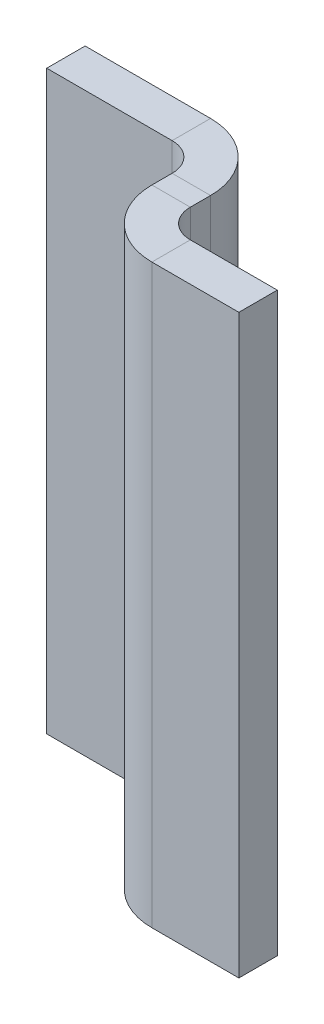
ISO-10303-21;
HEADER;
FILE_DESCRIPTION(('STEP AP214'),'2;1');
FILE_NAME('part.step','',(''),(''),'','','');
FILE_SCHEMA(('AUTOMOTIVE_DESIGN { 1 0 10303 214 1 1 1 1 }'));
ENDSEC;
DATA;
#1=APPLICATION_CONTEXT('core data for automotive mechanical design processes');
#2=APPLICATION_PROTOCOL_DEFINITION('international standard','automotive_design',2000,#1);
#3=PRODUCT_CONTEXT('',#1,'mechanical');
#4=PRODUCT('Part','Part','',(#3));
#5=PRODUCT_RELATED_PRODUCT_CATEGORY('part','',(#4));
#6=PRODUCT_DEFINITION_FORMATION('','',#4);
#7=PRODUCT_DEFINITION_CONTEXT('part definition',#1,'design');
#8=PRODUCT_DEFINITION('design','',#6,#7);
#9=PRODUCT_DEFINITION_SHAPE('','',#8);
#10=(LENGTH_UNIT() NAMED_UNIT(*) SI_UNIT(.MILLI.,.METRE.));
#11=(NAMED_UNIT(*) PLANE_ANGLE_UNIT() SI_UNIT($,.RADIAN.));
#12=(NAMED_UNIT(*) SI_UNIT($,.STERADIAN.) SOLID_ANGLE_UNIT());
#13=UNCERTAINTY_MEASURE_WITH_UNIT(LENGTH_MEASURE(1.E-05),#10,'distance_accuracy_value','');
#14=(GEOMETRIC_REPRESENTATION_CONTEXT(3) GLOBAL_UNCERTAINTY_ASSIGNED_CONTEXT((#13)) GLOBAL_UNIT_ASSIGNED_CONTEXT((#10,
#11,#12)) REPRESENTATION_CONTEXT('',''));
#15=CARTESIAN_POINT('',(0.,0.,0.));
#16=DIRECTION('',(0.,0.,1.));
#17=DIRECTION('',(1.,0.,0.));
#18=AXIS2_PLACEMENT_3D('',#15,#16,#17);
#19=CARTESIAN_POINT('',(5.,0.,0.));
#20=DIRECTION('',(0.,1.,0.));
#21=DIRECTION('',(0.,0.,1.));
#22=AXIS2_PLACEMENT_3D('',#19,#20,#21);
#23=PLANE('',#22);
#24=DIRECTION('',(-1.,0.,0.));
#25=VECTOR('',#24,1.);
#26=CARTESIAN_POINT('',(5.,0.,1.2634));
#27=LINE('',#26,#25);
#28=CARTESIAN_POINT('',(5.,0.,1.2634));
#29=VERTEX_POINT('',#28);
#30=CARTESIAN_POINT('',(4.,0.,1.26340000000001));
#31=VERTEX_POINT('',#30);
#32=EDGE_CURVE('E179',#29,#31,#27,.T.);
#33=ORIENTED_EDGE('',*,*,#32,.T.);
#34=DIRECTION('',(0.,0.,-1.));
#35=VECTOR('',#34,1.);
#36=CARTESIAN_POINT('',(4.,0.,0.));
#37=LINE('',#36,#35);
#38=CARTESIAN_POINT('',(4.,0.,0.736599999999997));
#39=VERTEX_POINT('',#38);
#40=EDGE_CURVE('E199',#31,#39,#37,.T.);
#41=ORIENTED_EDGE('',*,*,#40,.T.);
#42=DIRECTION('',(1.,0.,0.));
#43=VECTOR('',#42,1.);
#44=CARTESIAN_POINT('',(4.,0.,0.736599999999997));
#45=LINE('',#44,#43);
#46=CARTESIAN_POINT('',(5.,0.,0.736599999999994));
#47=VERTEX_POINT('',#46);
#48=EDGE_CURVE('E188',#39,#47,#45,.T.);
#49=ORIENTED_EDGE('',*,*,#48,.T.);
#50=DIRECTION('',(0.,0.,-1.));
#51=VECTOR('',#50,1.);
#52=CARTESIAN_POINT('',(5.,0.,0.));
#53=LINE('',#52,#51);
#54=EDGE_CURVE('E200',#29,#47,#53,.T.);
#55=ORIENTED_EDGE('',*,*,#54,.F.);
#56=EDGE_LOOP('',(#33,#41,#49,#55));
#57=FACE_BOUND('',#56,.T.);
#58=ADVANCED_FACE('F39',(#57),#23,.F.);
#59=CARTESIAN_POINT('',(5.00000000000001,15.,2.));
#60=DIRECTION('',(0.,-1.,0.));
#61=DIRECTION('',(0.,0.,-1.));
#62=AXIS2_PLACEMENT_3D('',#59,#60,#61);
#63=PLANE('',#62);
#64=DIRECTION('',(-1.,0.,0.));
#65=VECTOR('',#64,1.);
#66=CARTESIAN_POINT('',(5.,15.,1.2634));
#67=LINE('',#66,#65);
#68=CARTESIAN_POINT('',(5.,15.,1.2634));
#69=VERTEX_POINT('',#68);
#70=CARTESIAN_POINT('',(4.,15.,1.2634));
#71=VERTEX_POINT('',#70);
#72=EDGE_CURVE('E186',#69,#71,#67,.T.);
#73=ORIENTED_EDGE('',*,*,#72,.F.);
#74=DIRECTION('',(0.,0.,1.));
#75=VECTOR('',#74,1.);
#76=CARTESIAN_POINT('',(5.00000000000001,15.,2.));
#77=LINE('',#76,#75);
#78=CARTESIAN_POINT('',(5.,15.,0.736599999999994));
#79=VERTEX_POINT('',#78);
#80=EDGE_CURVE('E202',#79,#69,#77,.T.);
#81=ORIENTED_EDGE('',*,*,#80,.F.);
#82=DIRECTION('',(1.,0.,0.));
#83=VECTOR('',#82,1.);
#84=CARTESIAN_POINT('',(4.,15.,0.736599999999997));
#85=LINE('',#84,#83);
#86=CARTESIAN_POINT('',(4.,15.,0.736599999999997));
#87=VERTEX_POINT('',#86);
#88=EDGE_CURVE('E192',#87,#79,#85,.T.);
#89=ORIENTED_EDGE('',*,*,#88,.F.);
#90=DIRECTION('',(0.,0.,1.));
#91=VECTOR('',#90,1.);
#92=CARTESIAN_POINT('',(4.00000000000001,15.,2.));
#93=LINE('',#92,#91);
#94=EDGE_CURVE('E203',#87,#71,#93,.T.);
#95=ORIENTED_EDGE('',*,*,#94,.T.);
#96=EDGE_LOOP('',(#73,#81,#89,#95));
#97=FACE_BOUND('',#96,.T.);
#98=ADVANCED_FACE('F280',(#97),#63,.F.);
#99=CARTESIAN_POINT('',(5.,0.,0.));
#100=DIRECTION('',(-1.,0.,0.));
#101=DIRECTION('',(0.,0.,1.));
#102=AXIS2_PLACEMENT_3D('',#99,#100,#101);
#103=PLANE('',#102);
#104=DIRECTION('',(0.,-1.,0.));
#105=VECTOR('',#104,1.);
#106=CARTESIAN_POINT('',(5.,0.,1.2634));
#107=LINE('',#106,#105);
#108=EDGE_CURVE('E183',#29,#69,#107,.F.);
#109=ORIENTED_EDGE('',*,*,#108,.F.);
#110=ORIENTED_EDGE('',*,*,#54,.T.);
#111=DIRECTION('',(0.,-1.,0.));
#112=VECTOR('',#111,1.);
#113=CARTESIAN_POINT('',(5.,0.,0.736599999999994));
#114=LINE('',#113,#112);
#115=EDGE_CURVE('E195',#79,#47,#114,.T.);
#116=ORIENTED_EDGE('',*,*,#115,.F.);
#117=ORIENTED_EDGE('',*,*,#80,.T.);
#118=EDGE_LOOP('',(#109,#110,#116,#117));
#119=FACE_BOUND('',#118,.T.);
#120=ADVANCED_FACE('F277',(#119),#103,.F.);
#121=CARTESIAN_POINT('',(4.,0.,0.));
#122=DIRECTION('',(-1.,0.,0.));
#123=DIRECTION('',(0.,0.,1.));
#124=AXIS2_PLACEMENT_3D('',#121,#122,#123);
#125=PLANE('',#124);
#126=ORIENTED_EDGE('',*,*,#40,.F.);
#127=DIRECTION('',(0.,-1.,0.));
#128=VECTOR('',#127,1.);
#129=CARTESIAN_POINT('',(4.,0.,1.26340000000001));
#130=LINE('',#129,#128);
#131=EDGE_CURVE('E133',#31,#71,#130,.F.);
#132=ORIENTED_EDGE('',*,*,#131,.T.);
#133=ORIENTED_EDGE('',*,*,#94,.F.);
#134=DIRECTION('',(0.,1.,0.));
#135=VECTOR('',#134,1.);
#136=CARTESIAN_POINT('',(4.,0.,0.736599999999997));
#137=LINE('',#136,#135);
#138=EDGE_CURVE('E190',#39,#87,#137,.T.);
#139=ORIENTED_EDGE('',*,*,#138,.F.);
#140=EDGE_LOOP('',(#126,#132,#133,#139));
#141=FACE_BOUND('',#140,.T.);
#142=ADVANCED_FACE('F287',(#141),#125,.T.);
#143=CARTESIAN_POINT('',(0.,15.,-1.));
#144=DIRECTION('',(0.,1.,0.));
#145=DIRECTION('',(0.,0.,1.));
#146=AXIS2_PLACEMENT_3D('',#143,#144,#145);
#147=PLANE('',#146);
#148=DIRECTION('',(-1.,0.,0.));
#149=VECTOR('',#148,1.);
#150=CARTESIAN_POINT('',(0.,15.,0.));
#151=LINE('',#150,#149);
#152=CARTESIAN_POINT('',(3.2634,15.,0.));
#153=VERTEX_POINT('',#152);
#154=CARTESIAN_POINT('',(0.,15.,0.));
#155=VERTEX_POINT('',#154);
#156=EDGE_CURVE('E234',#153,#155,#151,.T.);
#157=ORIENTED_EDGE('',*,*,#156,.F.);
#158=DIRECTION('',(0.,0.,-1.));
#159=VECTOR('',#158,1.);
#160=CARTESIAN_POINT('',(3.2634,15.,0.));
#161=LINE('',#160,#159);
#162=CARTESIAN_POINT('',(3.2634,15.,-1.));
#163=VERTEX_POINT('',#162);
#164=EDGE_CURVE('E215',#153,#163,#161,.T.);
#165=ORIENTED_EDGE('',*,*,#164,.T.);
#166=DIRECTION('',(-1.,0.,0.));
#167=VECTOR('',#166,1.);
#168=CARTESIAN_POINT('',(0.,15.,-1.));
#169=LINE('',#168,#167);
#170=CARTESIAN_POINT('',(0.,15.,-1.));
#171=VERTEX_POINT('',#170);
#172=EDGE_CURVE('E237',#163,#171,#169,.T.);
#173=ORIENTED_EDGE('',*,*,#172,.T.);
#174=DIRECTION('',(0.,0.,1.));
#175=VECTOR('',#174,1.);
#176=CARTESIAN_POINT('',(0.,15.,-1.));
#177=LINE('',#176,#175);
#178=EDGE_CURVE('E11',#171,#155,#177,.T.);
#179=ORIENTED_EDGE('',*,*,#178,.T.);
#180=EDGE_LOOP('',(#157,#165,#173,#179));
#181=FACE_BOUND('',#180,.T.);
#182=ADVANCED_FACE('F251',(#181),#147,.T.);
#183=CARTESIAN_POINT('',(0.,0.,-1.));
#184=DIRECTION('',(0.,0.,-1.));
#185=DIRECTION('',(-1.,0.,0.));
#186=AXIS2_PLACEMENT_3D('',#183,#184,#185);
#187=PLANE('',#186);
#188=ORIENTED_EDGE('',*,*,#172,.F.);
#189=DIRECTION('',(0.,1.,0.));
#190=VECTOR('',#189,1.);
#191=CARTESIAN_POINT('',(3.2634,15.,-1.));
#192=LINE('',#191,#190);
#193=CARTESIAN_POINT('',(3.2634,0.,-1.));
#194=VERTEX_POINT('',#193);
#195=EDGE_CURVE('E210',#163,#194,#192,.F.);
#196=ORIENTED_EDGE('',*,*,#195,.T.);
#197=DIRECTION('',(1.,0.,0.));
#198=VECTOR('',#197,1.);
#199=CARTESIAN_POINT('',(0.,0.,-1.));
#200=LINE('',#199,#198);
#201=CARTESIAN_POINT('',(0.,0.,-1.));
#202=VERTEX_POINT('',#201);
#203=EDGE_CURVE('E233',#202,#194,#200,.T.);
#204=ORIENTED_EDGE('',*,*,#203,.F.);
#205=DIRECTION('',(0.,-1.,0.));
#206=VECTOR('',#205,1.);
#207=CARTESIAN_POINT('',(0.,0.,-1.));
#208=LINE('',#207,#206);
#209=EDGE_CURVE('E230',#171,#202,#208,.T.);
#210=ORIENTED_EDGE('',*,*,#209,.F.);
#211=EDGE_LOOP('',(#188,#196,#204,#210));
#212=FACE_BOUND('',#211,.T.);
#213=ADVANCED_FACE('F265',(#212),#187,.T.);
#214=CARTESIAN_POINT('',(0.,0.,0.));
#215=DIRECTION('',(0.,0.,-1.));
#216=DIRECTION('',(-1.,0.,0.));
#217=AXIS2_PLACEMENT_3D('',#214,#215,#216);
#218=PLANE('',#217);
#219=DIRECTION('',(0.,1.,0.));
#220=VECTOR('',#219,1.);
#221=CARTESIAN_POINT('',(3.2634,15.,0.));
#222=LINE('',#221,#220);
#223=CARTESIAN_POINT('',(3.2634,0.,0.));
#224=VERTEX_POINT('',#223);
#225=EDGE_CURVE('E221',#153,#224,#222,.F.);
#226=ORIENTED_EDGE('',*,*,#225,.F.);
#227=ORIENTED_EDGE('',*,*,#156,.T.);
#228=DIRECTION('',(0.,-1.,0.));
#229=VECTOR('',#228,1.);
#230=CARTESIAN_POINT('',(0.,0.,0.));
#231=LINE('',#230,#229);
#232=CARTESIAN_POINT('',(0.,0.,0.));
#233=VERTEX_POINT('',#232);
#234=EDGE_CURVE('E227',#155,#233,#231,.T.);
#235=ORIENTED_EDGE('',*,*,#234,.T.);
#236=DIRECTION('',(1.,0.,0.));
#237=VECTOR('',#236,1.);
#238=CARTESIAN_POINT('',(0.,0.,0.));
#239=LINE('',#238,#237);
#240=EDGE_CURVE('E241',#233,#224,#239,.T.);
#241=ORIENTED_EDGE('',*,*,#240,.T.);
#242=EDGE_LOOP('',(#226,#227,#235,#241));
#243=FACE_BOUND('',#242,.T.);
#244=ADVANCED_FACE('F247',(#243),#218,.F.);
#245=CARTESIAN_POINT('',(0.,0.,-1.));
#246=DIRECTION('',(-1.,0.,0.));
#247=DIRECTION('',(0.,0.,1.));
#248=AXIS2_PLACEMENT_3D('',#245,#246,#247);
#249=PLANE('',#248);
#250=ORIENTED_EDGE('',*,*,#234,.F.);
#251=ORIENTED_EDGE('',*,*,#178,.F.);
#252=ORIENTED_EDGE('',*,*,#209,.T.);
#253=DIRECTION('',(0.,0.,1.));
#254=VECTOR('',#253,1.);
#255=CARTESIAN_POINT('',(0.,0.,-1.));
#256=LINE('',#255,#254);
#257=EDGE_CURVE('E43',#202,#233,#256,.T.);
#258=ORIENTED_EDGE('',*,*,#257,.T.);
#259=EDGE_LOOP('',(#250,#251,#252,#258));
#260=FACE_BOUND('',#259,.T.);
#261=ADVANCED_FACE('F41',(#260),#249,.T.);
#262=CARTESIAN_POINT('',(0.,0.,-1.));
#263=DIRECTION('',(0.,-1.,0.));
#264=DIRECTION('',(0.,0.,-1.));
#265=AXIS2_PLACEMENT_3D('',#262,#263,#264);
#266=PLANE('',#265);
#267=DIRECTION('',(0.,0.,-1.));
#268=VECTOR('',#267,1.);
#269=CARTESIAN_POINT('',(3.2634,0.,0.));
#270=LINE('',#269,#268);
#271=EDGE_CURVE('E225',#224,#194,#270,.T.);
#272=ORIENTED_EDGE('',*,*,#271,.F.);
#273=ORIENTED_EDGE('',*,*,#240,.F.);
#274=ORIENTED_EDGE('',*,*,#257,.F.);
#275=ORIENTED_EDGE('',*,*,#203,.T.);
#276=EDGE_LOOP('',(#272,#273,#274,#275));
#277=FACE_BOUND('',#276,.T.);
#278=ADVANCED_FACE('F259',(#277),#266,.T.);
#279=CARTESIAN_POINT('',(3.2634,0.,0.7366));
#280=DIRECTION('',(0.,-1.,0.));
#281=DIRECTION('',(0.,0.,-1.));
#282=AXIS2_PLACEMENT_3D('',#279,#280,#281);
#283=PLANE('',#282);
#284=ORIENTED_EDGE('',*,*,#48,.F.);
#285=CARTESIAN_POINT('',(3.2634,0.,0.7366));
#286=DIRECTION('',(0.,1.,0.));
#287=DIRECTION('',(0.,0.,1.));
#288=AXIS2_PLACEMENT_3D('',#285,#286,#287);
#289=CIRCLE('',#288,0.7366);
#290=EDGE_CURVE('E218',#224,#39,#289,.F.);
#291=ORIENTED_EDGE('',*,*,#290,.F.);
#292=ORIENTED_EDGE('',*,*,#271,.T.);
#293=CARTESIAN_POINT('',(3.2634,0.,0.7366));
#294=DIRECTION('',(0.,1.,0.));
#295=DIRECTION('',(0.,0.,1.));
#296=AXIS2_PLACEMENT_3D('',#293,#294,#295);
#297=CIRCLE('',#296,1.7366);
#298=EDGE_CURVE('E62',#194,#47,#297,.F.);
#299=ORIENTED_EDGE('',*,*,#298,.T.);
#300=EDGE_LOOP('',(#284,#291,#292,#299));
#301=FACE_BOUND('',#300,.T.);
#302=ADVANCED_FACE('F263',(#301),#283,.T.);
#303=CARTESIAN_POINT('',(3.2634,15.,0.7366));
#304=DIRECTION('',(0.,-1.,0.));
#305=DIRECTION('',(0.,0.,-1.));
#306=AXIS2_PLACEMENT_3D('',#303,#304,#305);
#307=PLANE('',#306);
#308=CARTESIAN_POINT('',(3.2634,15.,0.7366));
#309=DIRECTION('',(0.,1.,0.));
#310=DIRECTION('',(0.,0.,1.));
#311=AXIS2_PLACEMENT_3D('',#308,#309,#310);
#312=CIRCLE('',#311,0.7366);
#313=EDGE_CURVE('E206',#87,#153,#312,.T.);
#314=ORIENTED_EDGE('',*,*,#313,.F.);
#315=ORIENTED_EDGE('',*,*,#88,.T.);
#316=CARTESIAN_POINT('',(3.2634,15.,0.7366));
#317=DIRECTION('',(0.,1.,0.));
#318=DIRECTION('',(0.,0.,1.));
#319=AXIS2_PLACEMENT_3D('',#316,#317,#318);
#320=CIRCLE('',#319,1.7366);
#321=EDGE_CURVE('E213',#79,#163,#320,.T.);
#322=ORIENTED_EDGE('',*,*,#321,.T.);
#323=ORIENTED_EDGE('',*,*,#164,.F.);
#324=EDGE_LOOP('',(#314,#315,#322,#323));
#325=FACE_BOUND('',#324,.T.);
#326=ADVANCED_FACE('F269',(#325),#307,.F.);
#327=CARTESIAN_POINT('',(3.2634,15.,0.7366));
#328=DIRECTION('',(0.,1.,0.));
#329=DIRECTION('',(1.,0.,0.));
#330=AXIS2_PLACEMENT_3D('',#327,#328,#329);
#331=CYLINDRICAL_SURFACE('',#330,1.7366);
#332=ORIENTED_EDGE('',*,*,#195,.F.);
#333=ORIENTED_EDGE('',*,*,#321,.F.);
#334=ORIENTED_EDGE('',*,*,#115,.T.);
#335=ORIENTED_EDGE('',*,*,#298,.F.);
#336=EDGE_LOOP('',(#332,#333,#334,#335));
#337=FACE_BOUND('',#336,.T.);
#338=ADVANCED_FACE('F266',(#337),#331,.T.);
#339=CARTESIAN_POINT('',(3.2634,15.,0.7366));
#340=DIRECTION('',(0.,1.,0.));
#341=DIRECTION('',(1.,0.,0.));
#342=AXIS2_PLACEMENT_3D('',#339,#340,#341);
#343=CYLINDRICAL_SURFACE('',#342,0.7366);
#344=ORIENTED_EDGE('',*,*,#225,.T.);
#345=ORIENTED_EDGE('',*,*,#290,.T.);
#346=ORIENTED_EDGE('',*,*,#138,.T.);
#347=ORIENTED_EDGE('',*,*,#313,.T.);
#348=EDGE_LOOP('',(#344,#345,#346,#347));
#349=FACE_BOUND('',#348,.T.);
#350=ADVANCED_FACE('F291',(#349),#343,.F.);
#351=CARTESIAN_POINT('',(5.7366,15.,1.2634));
#352=DIRECTION('',(0.,1.,0.));
#353=DIRECTION('',(0.,0.,1.));
#354=AXIS2_PLACEMENT_3D('',#351,#352,#353);
#355=PLANE('',#354);
#356=DIRECTION('',(0.,0.,1.));
#357=VECTOR('',#356,1.);
#358=CARTESIAN_POINT('',(5.7366,15.,2.));
#359=LINE('',#358,#357);
#360=CARTESIAN_POINT('',(5.7366,15.,2.));
#361=VERTEX_POINT('',#360);
#362=CARTESIAN_POINT('',(5.7366,15.,3.));
#363=VERTEX_POINT('',#362);
#364=EDGE_CURVE('E522',#361,#363,#359,.T.);
#365=ORIENTED_EDGE('',*,*,#364,.F.);
#366=CARTESIAN_POINT('',(5.7366,15.,1.2634));
#367=DIRECTION('',(0.,-1.,0.));
#368=DIRECTION('',(0.,0.,-1.));
#369=AXIS2_PLACEMENT_3D('',#366,#367,#368);
#370=CIRCLE('',#369,0.7366);
#371=EDGE_CURVE('E136',#69,#361,#370,.F.);
#372=ORIENTED_EDGE('',*,*,#371,.F.);
#373=ORIENTED_EDGE('',*,*,#72,.T.);
#374=CARTESIAN_POINT('',(5.7366,15.,1.2634));
#375=DIRECTION('',(0.,-1.,0.));
#376=DIRECTION('',(0.,0.,-1.));
#377=AXIS2_PLACEMENT_3D('',#374,#375,#376);
#378=CIRCLE('',#377,1.7366);
#379=EDGE_CURVE('E54',#71,#363,#378,.F.);
#380=ORIENTED_EDGE('',*,*,#379,.T.);
#381=EDGE_LOOP('',(#365,#372,#373,#380));
#382=FACE_BOUND('',#381,.T.);
#383=ADVANCED_FACE('F283',(#382),#355,.T.);
#384=CARTESIAN_POINT('',(5.7366,0.,1.2634));
#385=DIRECTION('',(0.,1.,0.));
#386=DIRECTION('',(0.,0.,1.));
#387=AXIS2_PLACEMENT_3D('',#384,#385,#386);
#388=PLANE('',#387);
#389=CARTESIAN_POINT('',(5.7366,0.,1.2634));
#390=DIRECTION('',(0.,-1.,0.));
#391=DIRECTION('',(0.,0.,-1.));
#392=AXIS2_PLACEMENT_3D('',#389,#390,#391);
#393=CIRCLE('',#392,0.7366);
#394=CARTESIAN_POINT('',(5.7366,0.,2.));
#395=VERTEX_POINT('',#394);
#396=EDGE_CURVE('E143',#395,#29,#393,.T.);
#397=ORIENTED_EDGE('',*,*,#396,.F.);
#398=DIRECTION('',(0.,0.,1.));
#399=VECTOR('',#398,1.);
#400=CARTESIAN_POINT('',(5.7366,0.,2.));
#401=LINE('',#400,#399);
#402=CARTESIAN_POINT('',(5.7366,0.,3.));
#403=VERTEX_POINT('',#402);
#404=EDGE_CURVE('E140',#395,#403,#401,.T.);
#405=ORIENTED_EDGE('',*,*,#404,.T.);
#406=CARTESIAN_POINT('',(5.7366,0.,1.2634));
#407=DIRECTION('',(0.,-1.,0.));
#408=DIRECTION('',(0.,0.,-1.));
#409=AXIS2_PLACEMENT_3D('',#406,#407,#408);
#410=CIRCLE('',#409,1.7366);
#411=EDGE_CURVE('E127',#403,#31,#410,.T.);
#412=ORIENTED_EDGE('',*,*,#411,.T.);
#413=ORIENTED_EDGE('',*,*,#32,.F.);
#414=EDGE_LOOP('',(#397,#405,#412,#413));
#415=FACE_BOUND('',#414,.T.);
#416=ADVANCED_FACE('F141',(#415),#388,.F.);
#417=CARTESIAN_POINT('',(5.7366,0.,1.2634));
#418=DIRECTION('',(0.,-1.,0.));
#419=DIRECTION('',(0.,0.,1.));
#420=AXIS2_PLACEMENT_3D('',#417,#418,#419);
#421=CYLINDRICAL_SURFACE('',#420,1.7366);
#422=ORIENTED_EDGE('',*,*,#131,.F.);
#423=ORIENTED_EDGE('',*,*,#411,.F.);
#424=DIRECTION('',(0.,1.,0.));
#425=VECTOR('',#424,1.);
#426=CARTESIAN_POINT('',(5.7366,0.,3.));
#427=LINE('',#426,#425);
#428=EDGE_CURVE('E131',#403,#363,#427,.T.);
#429=ORIENTED_EDGE('',*,*,#428,.T.);
#430=ORIENTED_EDGE('',*,*,#379,.F.);
#431=EDGE_LOOP('',(#422,#423,#429,#430));
#432=FACE_BOUND('',#431,.T.);
#433=ADVANCED_FACE('F129',(#432),#421,.T.);
#434=CARTESIAN_POINT('',(5.7366,0.,1.2634));
#435=DIRECTION('',(0.,-1.,0.));
#436=DIRECTION('',(0.,0.,1.));
#437=AXIS2_PLACEMENT_3D('',#434,#435,#436);
#438=CYLINDRICAL_SURFACE('',#437,0.7366);
#439=ORIENTED_EDGE('',*,*,#108,.T.);
#440=ORIENTED_EDGE('',*,*,#371,.T.);
#441=DIRECTION('',(0.,-1.,0.));
#442=VECTOR('',#441,1.);
#443=CARTESIAN_POINT('',(5.7366,15.,2.));
#444=LINE('',#443,#442);
#445=EDGE_CURVE('E147',#361,#395,#444,.T.);
#446=ORIENTED_EDGE('',*,*,#445,.T.);
#447=ORIENTED_EDGE('',*,*,#396,.T.);
#448=EDGE_LOOP('',(#439,#440,#446,#447));
#449=FACE_BOUND('',#448,.T.);
#450=ADVANCED_FACE('F314',(#449),#438,.F.);
#451=CARTESIAN_POINT('',(8.00000000000001,0.,3.));
#452=DIRECTION('',(0.,1.,0.));
#453=DIRECTION('',(0.,0.,1.));
#454=AXIS2_PLACEMENT_3D('',#451,#452,#453);
#455=PLANE('',#454);
#456=ORIENTED_EDGE('',*,*,#404,.F.);
#457=DIRECTION('',(1.,0.,0.));
#458=VECTOR('',#457,1.);
#459=CARTESIAN_POINT('',(8.00000000000001,0.,2.));
#460=LINE('',#459,#458);
#461=CARTESIAN_POINT('',(8.00000000000001,0.,2.));
#462=VERTEX_POINT('',#461);
#463=EDGE_CURVE('E156',#395,#462,#460,.T.);
#464=ORIENTED_EDGE('',*,*,#463,.T.);
#465=DIRECTION('',(0.,0.,-1.));
#466=VECTOR('',#465,1.);
#467=CARTESIAN_POINT('',(8.00000000000001,0.,3.));
#468=LINE('',#467,#466);
#469=CARTESIAN_POINT('',(8.00000000000001,0.,3.));
#470=VERTEX_POINT('',#469);
#471=EDGE_CURVE('E160',#470,#462,#468,.T.);
#472=ORIENTED_EDGE('',*,*,#471,.F.);
#473=DIRECTION('',(1.,0.,0.));
#474=VECTOR('',#473,1.);
#475=CARTESIAN_POINT('',(8.00000000000001,0.,3.));
#476=LINE('',#475,#474);
#477=EDGE_CURVE('E152',#403,#470,#476,.T.);
#478=ORIENTED_EDGE('',*,*,#477,.F.);
#479=EDGE_LOOP('',(#456,#464,#472,#478));
#480=FACE_BOUND('',#479,.T.);
#481=ADVANCED_FACE('F158',(#480),#455,.F.);
#482=CARTESIAN_POINT('',(5.00000000000001,15.,3.));
#483=DIRECTION('',(0.,-1.,0.));
#484=DIRECTION('',(0.,0.,-1.));
#485=AXIS2_PLACEMENT_3D('',#482,#483,#484);
#486=PLANE('',#485);
#487=ORIENTED_EDGE('',*,*,#364,.T.);
#488=DIRECTION('',(-1.,0.,0.));
#489=VECTOR('',#488,1.);
#490=CARTESIAN_POINT('',(5.00000000000001,15.,3.));
#491=LINE('',#490,#489);
#492=CARTESIAN_POINT('',(8.00000000000001,15.,3.));
#493=VERTEX_POINT('',#492);
#494=EDGE_CURVE('E155',#493,#363,#491,.T.);
#495=ORIENTED_EDGE('',*,*,#494,.F.);
#496=DIRECTION('',(0.,0.,-1.));
#497=VECTOR('',#496,1.);
#498=CARTESIAN_POINT('',(8.00000000000001,15.,3.));
#499=LINE('',#498,#497);
#500=CARTESIAN_POINT('',(8.00000000000001,15.,2.));
#501=VERTEX_POINT('',#500);
#502=EDGE_CURVE('E172',#493,#501,#499,.T.);
#503=ORIENTED_EDGE('',*,*,#502,.T.);
#504=DIRECTION('',(-1.,0.,0.));
#505=VECTOR('',#504,1.);
#506=CARTESIAN_POINT('',(5.00000000000001,15.,2.));
#507=LINE('',#506,#505);
#508=EDGE_CURVE('E163',#501,#361,#507,.T.);
#509=ORIENTED_EDGE('',*,*,#508,.T.);
#510=EDGE_LOOP('',(#487,#495,#503,#509));
#511=FACE_BOUND('',#510,.T.);
#512=ADVANCED_FACE('F322',(#511),#486,.F.);
#513=CARTESIAN_POINT('',(0.,0.,3.));
#514=DIRECTION('',(0.,0.,-1.));
#515=DIRECTION('',(-1.,0.,0.));
#516=AXIS2_PLACEMENT_3D('',#513,#514,#515);
#517=PLANE('',#516);
#518=ORIENTED_EDGE('',*,*,#428,.F.);
#519=ORIENTED_EDGE('',*,*,#477,.T.);
#520=DIRECTION('',(0.,1.,0.));
#521=VECTOR('',#520,1.);
#522=CARTESIAN_POINT('',(8.00000000000001,15.,3.));
#523=LINE('',#522,#521);
#524=EDGE_CURVE('E162',#470,#493,#523,.T.);
#525=ORIENTED_EDGE('',*,*,#524,.T.);
#526=ORIENTED_EDGE('',*,*,#494,.T.);
#527=EDGE_LOOP('',(#518,#519,#525,#526));
#528=FACE_BOUND('',#527,.T.);
#529=ADVANCED_FACE('F151',(#528),#517,.F.);
#530=CARTESIAN_POINT('',(0.,0.,2.));
#531=DIRECTION('',(0.,0.,-1.));
#532=DIRECTION('',(-1.,0.,0.));
#533=AXIS2_PLACEMENT_3D('',#530,#531,#532);
#534=PLANE('',#533);
#535=ORIENTED_EDGE('',*,*,#463,.F.);
#536=ORIENTED_EDGE('',*,*,#445,.F.);
#537=ORIENTED_EDGE('',*,*,#508,.F.);
#538=DIRECTION('',(0.,1.,0.));
#539=VECTOR('',#538,1.);
#540=CARTESIAN_POINT('',(8.00000000000001,15.,2.));
#541=LINE('',#540,#539);
#542=EDGE_CURVE('E167',#462,#501,#541,.T.);
#543=ORIENTED_EDGE('',*,*,#542,.F.);
#544=EDGE_LOOP('',(#535,#536,#537,#543));
#545=FACE_BOUND('',#544,.T.);
#546=ADVANCED_FACE('F326',(#545),#534,.T.);
#547=CARTESIAN_POINT('',(8.00000000000001,15.,3.));
#548=DIRECTION('',(-1.,0.,0.));
#549=DIRECTION('',(0.,0.,1.));
#550=AXIS2_PLACEMENT_3D('',#547,#548,#549);
#551=PLANE('',#550);
#552=ORIENTED_EDGE('',*,*,#542,.T.);
#553=ORIENTED_EDGE('',*,*,#502,.F.);
#554=ORIENTED_EDGE('',*,*,#524,.F.);
#555=ORIENTED_EDGE('',*,*,#471,.T.);
#556=EDGE_LOOP('',(#552,#553,#554,#555));
#557=FACE_BOUND('',#556,.T.);
#558=ADVANCED_FACE('F323',(#557),#551,.F.);
#559=CLOSED_SHELL('',(#58,#98,#120,#142,#182,#213,#244,#261,#278,#302,#326,#338,#350,#383,#416,
#433,#450,#481,#512,#529,#546,#558));
#560=MANIFOLD_SOLID_BREP('B2',#559);
#561=ADVANCED_BREP_SHAPE_REPRESENTATION('',(#18,#560),#14);
#562=SHAPE_DEFINITION_REPRESENTATION(#9,#561);
ENDSEC;
END-ISO-10303-21;
